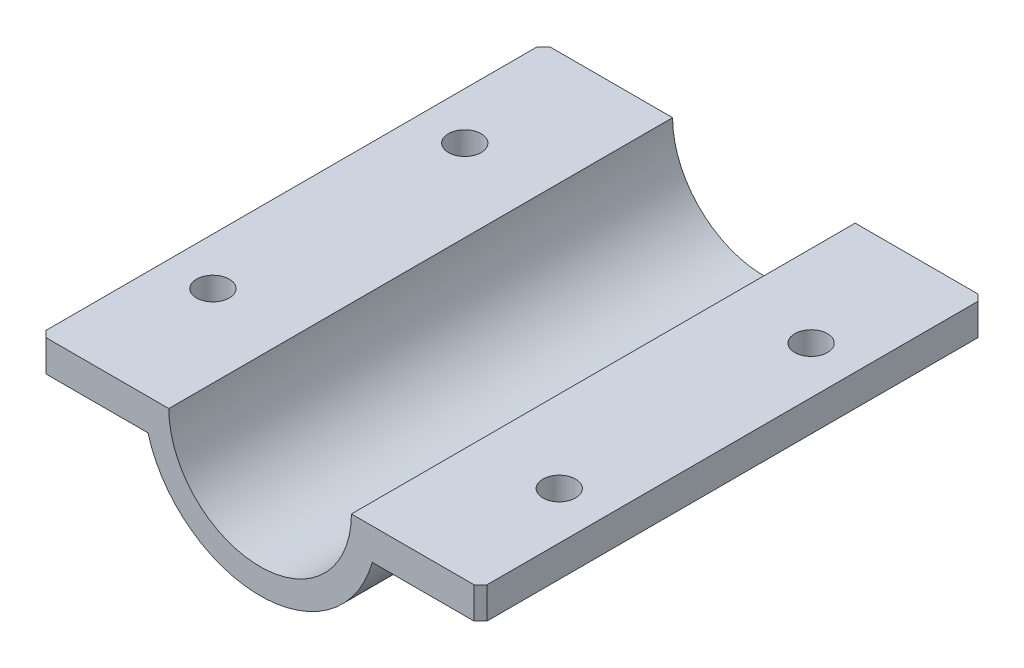
ISO-10303-21;
HEADER;
FILE_DESCRIPTION(('STEP AP214'),'2;1');
FILE_NAME('part.step','',(''),(''),'','','');
FILE_SCHEMA(('AUTOMOTIVE_DESIGN { 1 0 10303 214 1 1 1 1 }'));
ENDSEC;
DATA;
#1=APPLICATION_CONTEXT('core data for automotive mechanical design processes');
#2=APPLICATION_PROTOCOL_DEFINITION('international standard','automotive_design',2000,#1);
#3=PRODUCT_CONTEXT('',#1,'mechanical');
#4=PRODUCT('Part','Part','',(#3));
#5=PRODUCT_RELATED_PRODUCT_CATEGORY('part','',(#4));
#6=PRODUCT_DEFINITION_FORMATION('','',#4);
#7=PRODUCT_DEFINITION_CONTEXT('part definition',#1,'design');
#8=PRODUCT_DEFINITION('design','',#6,#7);
#9=PRODUCT_DEFINITION_SHAPE('','',#8);
#10=(LENGTH_UNIT() NAMED_UNIT(*) SI_UNIT(.MILLI.,.METRE.));
#11=(NAMED_UNIT(*) PLANE_ANGLE_UNIT() SI_UNIT($,.RADIAN.));
#12=(NAMED_UNIT(*) SI_UNIT($,.STERADIAN.) SOLID_ANGLE_UNIT());
#13=UNCERTAINTY_MEASURE_WITH_UNIT(LENGTH_MEASURE(1.E-05),#10,'distance_accuracy_value','');
#14=(GEOMETRIC_REPRESENTATION_CONTEXT(3) GLOBAL_UNCERTAINTY_ASSIGNED_CONTEXT((#13)) GLOBAL_UNIT_ASSIGNED_CONTEXT((#10,
#11,#12)) REPRESENTATION_CONTEXT('',''));
#15=CARTESIAN_POINT('',(0.,0.,0.));
#16=DIRECTION('',(0.,0.,1.));
#17=DIRECTION('',(1.,0.,0.));
#18=AXIS2_PLACEMENT_3D('',#15,#16,#17);
#19=CARTESIAN_POINT('',(35.,0.,40.));
#20=DIRECTION('',(-1.,0.,0.));
#21=DIRECTION('',(0.,0.,1.));
#22=AXIS2_PLACEMENT_3D('',#19,#20,#21);
#23=PLANE('',#22);
#24=DIRECTION('',(0.,0.,-1.));
#25=VECTOR('',#24,1.);
#26=CARTESIAN_POINT('',(35.,-5.,40.));
#27=LINE('',#26,#25);
#28=CARTESIAN_POINT('',(35.,-5.,39.));
#29=VERTEX_POINT('',#28);
#30=CARTESIAN_POINT('',(35.,-5.,-39.));
#31=VERTEX_POINT('',#30);
#32=EDGE_CURVE('E164',#29,#31,#27,.T.);
#33=ORIENTED_EDGE('',*,*,#32,.T.);
#34=DIRECTION('',(0.,1.,0.));
#35=VECTOR('',#34,1.);
#36=CARTESIAN_POINT('',(35.,0.,-39.));
#37=LINE('',#36,#35);
#38=CARTESIAN_POINT('',(35.,0.,-39.));
#39=VERTEX_POINT('',#38);
#40=EDGE_CURVE('E214',#31,#39,#37,.T.);
#41=ORIENTED_EDGE('',*,*,#40,.T.);
#42=DIRECTION('',(0.,0.,-1.));
#43=VECTOR('',#42,1.);
#44=CARTESIAN_POINT('',(35.,0.,40.));
#45=LINE('',#44,#43);
#46=CARTESIAN_POINT('',(35.,0.,39.));
#47=VERTEX_POINT('',#46);
#48=EDGE_CURVE('E147',#47,#39,#45,.T.);
#49=ORIENTED_EDGE('',*,*,#48,.F.);
#50=DIRECTION('',(0.,-1.,0.));
#51=VECTOR('',#50,1.);
#52=CARTESIAN_POINT('',(35.,-5.,39.));
#53=LINE('',#52,#51);
#54=EDGE_CURVE('E212',#47,#29,#53,.T.);
#55=ORIENTED_EDGE('',*,*,#54,.T.);
#56=EDGE_LOOP('',(#33,#41,#49,#55));
#57=FACE_BOUND('',#56,.T.);
#58=ADVANCED_FACE('F38',(#57),#23,.F.);
#59=CARTESIAN_POINT('',(35.,0.,40.));
#60=DIRECTION('',(0.,-1.,0.));
#61=DIRECTION('',(1.,0.,0.));
#62=AXIS2_PLACEMENT_3D('',#59,#60,#61);
#63=PLANE('',#62);
#64=CARTESIAN_POINT('',(27.5,0.,20.));
#65=DIRECTION('',(0.,-1.,0.));
#66=DIRECTION('',(1.,0.,0.));
#67=AXIS2_PLACEMENT_3D('',#64,#65,#66);
#68=CIRCLE('',#67,2.6);
#69=CARTESIAN_POINT('',(30.1,0.,20.));
#70=VERTEX_POINT('',#69);
#71=EDGE_CURVE('E319',#70,#70,#68,.T.);
#72=ORIENTED_EDGE('',*,*,#71,.T.);
#73=EDGE_LOOP('',(#72));
#74=FACE_BOUND('',#73,.T.);
#75=CARTESIAN_POINT('',(27.5,0.,-20.));
#76=DIRECTION('',(0.,-1.,0.));
#77=DIRECTION('',(1.,0.,0.));
#78=AXIS2_PLACEMENT_3D('',#75,#76,#77);
#79=CIRCLE('',#78,2.6);
#80=CARTESIAN_POINT('',(30.1,0.,-20.));
#81=VERTEX_POINT('',#80);
#82=EDGE_CURVE('E317',#81,#81,#79,.T.);
#83=ORIENTED_EDGE('',*,*,#82,.T.);
#84=EDGE_LOOP('',(#83));
#85=FACE_BOUND('',#84,.T.);
#86=ORIENTED_EDGE('',*,*,#48,.T.);
#87=DIRECTION('',(0.707106781186552,0.,0.707106781186543));
#88=VECTOR('',#87,1.);
#89=CARTESIAN_POINT('',(35.,0.,-39.));
#90=LINE('',#89,#88);
#91=CARTESIAN_POINT('',(34.,0.,-40.));
#92=VERTEX_POINT('',#91);
#93=EDGE_CURVE('E218',#39,#92,#90,.F.);
#94=ORIENTED_EDGE('',*,*,#93,.T.);
#95=DIRECTION('',(-1.,0.,0.));
#96=VECTOR('',#95,1.);
#97=CARTESIAN_POINT('',(35.,0.,-40.));
#98=LINE('',#97,#96);
#99=CARTESIAN_POINT('',(14.5,0.,-40.));
#100=VERTEX_POINT('',#99);
#101=EDGE_CURVE('E144',#92,#100,#98,.T.);
#102=ORIENTED_EDGE('',*,*,#101,.T.);
#103=DIRECTION('',(0.,0.,-1.));
#104=VECTOR('',#103,1.);
#105=CARTESIAN_POINT('',(14.5,0.,40.));
#106=LINE('',#105,#104);
#107=CARTESIAN_POINT('',(14.5,0.,40.));
#108=VERTEX_POINT('',#107);
#109=EDGE_CURVE('E140',#108,#100,#106,.T.);
#110=ORIENTED_EDGE('',*,*,#109,.F.);
#111=DIRECTION('',(-1.,0.,0.));
#112=VECTOR('',#111,1.);
#113=CARTESIAN_POINT('',(35.,0.,40.));
#114=LINE('',#113,#112);
#115=CARTESIAN_POINT('',(34.,0.,40.));
#116=VERTEX_POINT('',#115);
#117=EDGE_CURVE('E129',#116,#108,#114,.T.);
#118=ORIENTED_EDGE('',*,*,#117,.F.);
#119=DIRECTION('',(0.707106781186543,0.,-0.707106781186552));
#120=VECTOR('',#119,1.);
#121=CARTESIAN_POINT('',(34.,0.,40.));
#122=LINE('',#121,#120);
#123=EDGE_CURVE('E62',#116,#47,#122,.T.);
#124=ORIENTED_EDGE('',*,*,#123,.T.);
#125=EDGE_LOOP('',(#86,#94,#102,#110,#118,#124));
#126=FACE_BOUND('',#125,.T.);
#127=ADVANCED_FACE('F142',(#74,#85,#126),#63,.F.);
#128=CARTESIAN_POINT('',(0.,0.,40.));
#129=DIRECTION('',(0.,0.,-1.));
#130=DIRECTION('',(-1.,0.,0.));
#131=AXIS2_PLACEMENT_3D('',#128,#129,#130);
#132=CYLINDRICAL_SURFACE('',#131,14.5);
#133=CARTESIAN_POINT('',(0.,0.,-40.));
#134=DIRECTION('',(0.,0.,-1.));
#135=DIRECTION('',(1.,0.,0.));
#136=AXIS2_PLACEMENT_3D('',#133,#134,#135);
#137=CIRCLE('',#136,14.5);
#138=CARTESIAN_POINT('',(-14.5,0.,-40.));
#139=VERTEX_POINT('',#138);
#140=EDGE_CURVE('E166',#100,#139,#137,.T.);
#141=ORIENTED_EDGE('',*,*,#140,.T.);
#142=DIRECTION('',(0.,0.,-1.));
#143=VECTOR('',#142,1.);
#144=CARTESIAN_POINT('',(-14.5,0.,40.));
#145=LINE('',#144,#143);
#146=CARTESIAN_POINT('',(-14.5,0.,40.));
#147=VERTEX_POINT('',#146);
#148=EDGE_CURVE('E148',#147,#139,#145,.T.);
#149=ORIENTED_EDGE('',*,*,#148,.F.);
#150=CARTESIAN_POINT('',(0.,0.,40.));
#151=DIRECTION('',(0.,0.,-1.));
#152=DIRECTION('',(1.,0.,0.));
#153=AXIS2_PLACEMENT_3D('',#150,#151,#152);
#154=CIRCLE('',#153,14.5);
#155=EDGE_CURVE('E134',#108,#147,#154,.T.);
#156=ORIENTED_EDGE('',*,*,#155,.F.);
#157=ORIENTED_EDGE('',*,*,#109,.T.);
#158=EDGE_LOOP('',(#141,#149,#156,#157));
#159=FACE_BOUND('',#158,.T.);
#160=ADVANCED_FACE('F150',(#159),#132,.F.);
#161=CARTESIAN_POINT('',(-14.5,0.,40.));
#162=DIRECTION('',(0.,-1.,0.));
#163=DIRECTION('',(1.,0.,0.));
#164=AXIS2_PLACEMENT_3D('',#161,#162,#163);
#165=PLANE('',#164);
#166=CARTESIAN_POINT('',(-27.5,0.,-20.));
#167=DIRECTION('',(0.,-1.,0.));
#168=DIRECTION('',(1.,0.,0.));
#169=AXIS2_PLACEMENT_3D('',#166,#167,#168);
#170=CIRCLE('',#169,2.6);
#171=CARTESIAN_POINT('',(-24.9,0.,-20.));
#172=VERTEX_POINT('',#171);
#173=EDGE_CURVE('E167',#172,#172,#170,.T.);
#174=ORIENTED_EDGE('',*,*,#173,.T.);
#175=EDGE_LOOP('',(#174));
#176=FACE_BOUND('',#175,.T.);
#177=CARTESIAN_POINT('',(-27.5,0.,20.));
#178=DIRECTION('',(0.,-1.,0.));
#179=DIRECTION('',(1.,0.,0.));
#180=AXIS2_PLACEMENT_3D('',#177,#178,#179);
#181=CIRCLE('',#180,2.6);
#182=CARTESIAN_POINT('',(-24.9,0.,20.));
#183=VERTEX_POINT('',#182);
#184=EDGE_CURVE('E323',#183,#183,#181,.T.);
#185=ORIENTED_EDGE('',*,*,#184,.T.);
#186=EDGE_LOOP('',(#185));
#187=FACE_BOUND('',#186,.T.);
#188=DIRECTION('',(-1.,0.,0.));
#189=VECTOR('',#188,1.);
#190=CARTESIAN_POINT('',(-14.5,0.,-40.));
#191=LINE('',#190,#189);
#192=CARTESIAN_POINT('',(-34.,0.,-40.));
#193=VERTEX_POINT('',#192);
#194=EDGE_CURVE('E169',#139,#193,#191,.T.);
#195=ORIENTED_EDGE('',*,*,#194,.T.);
#196=DIRECTION('',(0.707106781186552,0.,-0.707106781186543));
#197=VECTOR('',#196,1.);
#198=CARTESIAN_POINT('',(-35.,0.,-39.));
#199=LINE('',#198,#197);
#200=CARTESIAN_POINT('',(-35.,0.,-39.));
#201=VERTEX_POINT('',#200);
#202=EDGE_CURVE('E210',#193,#201,#199,.F.);
#203=ORIENTED_EDGE('',*,*,#202,.T.);
#204=DIRECTION('',(0.,0.,-1.));
#205=VECTOR('',#204,1.);
#206=CARTESIAN_POINT('',(-35.,0.,40.));
#207=LINE('',#206,#205);
#208=CARTESIAN_POINT('',(-35.,0.,39.));
#209=VERTEX_POINT('',#208);
#210=EDGE_CURVE('E190',#209,#201,#207,.T.);
#211=ORIENTED_EDGE('',*,*,#210,.F.);
#212=DIRECTION('',(0.707106781186543,0.,0.707106781186552));
#213=VECTOR('',#212,1.);
#214=CARTESIAN_POINT('',(-34.,0.,40.));
#215=LINE('',#214,#213);
#216=CARTESIAN_POINT('',(-34.,0.,40.));
#217=VERTEX_POINT('',#216);
#218=EDGE_CURVE('E208',#209,#217,#215,.T.);
#219=ORIENTED_EDGE('',*,*,#218,.T.);
#220=DIRECTION('',(-1.,0.,0.));
#221=VECTOR('',#220,1.);
#222=CARTESIAN_POINT('',(-14.5,0.,40.));
#223=LINE('',#222,#221);
#224=EDGE_CURVE('E153',#147,#217,#223,.T.);
#225=ORIENTED_EDGE('',*,*,#224,.F.);
#226=ORIENTED_EDGE('',*,*,#148,.T.);
#227=EDGE_LOOP('',(#195,#203,#211,#219,#225,#226));
#228=FACE_BOUND('',#227,.T.);
#229=ADVANCED_FACE('F250',(#176,#187,#228),#165,.F.);
#230=CARTESIAN_POINT('',(-35.,0.,40.));
#231=DIRECTION('',(1.,0.,0.));
#232=DIRECTION('',(0.,0.,-1.));
#233=AXIS2_PLACEMENT_3D('',#230,#231,#232);
#234=PLANE('',#233);
#235=ORIENTED_EDGE('',*,*,#210,.T.);
#236=DIRECTION('',(0.,-1.,0.));
#237=VECTOR('',#236,1.);
#238=CARTESIAN_POINT('',(-35.,0.,-39.));
#239=LINE('',#238,#237);
#240=CARTESIAN_POINT('',(-35.,-5.,-39.));
#241=VERTEX_POINT('',#240);
#242=EDGE_CURVE('E197',#201,#241,#239,.T.);
#243=ORIENTED_EDGE('',*,*,#242,.T.);
#244=DIRECTION('',(0.,0.,-1.));
#245=VECTOR('',#244,1.);
#246=CARTESIAN_POINT('',(-35.,-5.,40.));
#247=LINE('',#246,#245);
#248=CARTESIAN_POINT('',(-35.,-5.,39.));
#249=VERTEX_POINT('',#248);
#250=EDGE_CURVE('E187',#249,#241,#247,.T.);
#251=ORIENTED_EDGE('',*,*,#250,.F.);
#252=DIRECTION('',(0.,1.,0.));
#253=VECTOR('',#252,1.);
#254=CARTESIAN_POINT('',(-35.,0.,39.));
#255=LINE('',#254,#253);
#256=EDGE_CURVE('E195',#249,#209,#255,.T.);
#257=ORIENTED_EDGE('',*,*,#256,.T.);
#258=EDGE_LOOP('',(#235,#243,#251,#257));
#259=FACE_BOUND('',#258,.T.);
#260=ADVANCED_FACE('F255',(#259),#234,.F.);
#261=CARTESIAN_POINT('',(-21.9374109684803,-5.00000000000001,40.));
#262=DIRECTION('',(0.,1.,0.));
#263=DIRECTION('',(0.,0.,1.));
#264=AXIS2_PLACEMENT_3D('',#261,#262,#263);
#265=PLANE('',#264);
#266=CARTESIAN_POINT('',(-27.5,-5.00000000000001,-20.));
#267=DIRECTION('',(0.,-1.,0.));
#268=DIRECTION('',(0.,0.,1.));
#269=AXIS2_PLACEMENT_3D('',#266,#267,#268);
#270=CIRCLE('',#269,2.6);
#271=CARTESIAN_POINT('',(-27.5,-5.00000000000001,-17.4));
#272=VERTEX_POINT('',#271);
#273=EDGE_CURVE('E326',#272,#272,#270,.T.);
#274=ORIENTED_EDGE('',*,*,#273,.F.);
#275=EDGE_LOOP('',(#274));
#276=FACE_BOUND('',#275,.T.);
#277=CARTESIAN_POINT('',(-27.5,-5.00000000000001,20.));
#278=DIRECTION('',(0.,-1.,0.));
#279=DIRECTION('',(0.,0.,-1.));
#280=AXIS2_PLACEMENT_3D('',#277,#278,#279);
#281=CIRCLE('',#280,2.6);
#282=CARTESIAN_POINT('',(-27.5,-5.00000000000001,17.4));
#283=VERTEX_POINT('',#282);
#284=EDGE_CURVE('E320',#283,#283,#281,.T.);
#285=ORIENTED_EDGE('',*,*,#284,.F.);
#286=EDGE_LOOP('',(#285));
#287=FACE_BOUND('',#286,.T.);
#288=ORIENTED_EDGE('',*,*,#250,.T.);
#289=DIRECTION('',(-0.707106781186552,0.,0.707106781186543));
#290=VECTOR('',#289,1.);
#291=CARTESIAN_POINT('',(-35.,-5.00000000000001,-39.));
#292=LINE('',#291,#290);
#293=CARTESIAN_POINT('',(-34.,-5.00000000000001,-40.));
#294=VERTEX_POINT('',#293);
#295=EDGE_CURVE('E202',#241,#294,#292,.F.);
#296=ORIENTED_EDGE('',*,*,#295,.T.);
#297=DIRECTION('',(1.,0.,0.));
#298=VECTOR('',#297,1.);
#299=CARTESIAN_POINT('',(-21.9374109684803,-5.00000000000001,-40.));
#300=LINE('',#299,#298);
#301=CARTESIAN_POINT('',(-17.8115131305569,-5.00000000000001,-40.));
#302=VERTEX_POINT('',#301);
#303=EDGE_CURVE('E172',#294,#302,#300,.T.);
#304=ORIENTED_EDGE('',*,*,#303,.T.);
#305=DIRECTION('',(0.,0.,-1.));
#306=VECTOR('',#305,1.);
#307=CARTESIAN_POINT('',(-17.8115131305569,-5.00000000000001,40.));
#308=LINE('',#307,#306);
#309=CARTESIAN_POINT('',(-17.8115131305569,-5.00000000000001,40.));
#310=VERTEX_POINT('',#309);
#311=EDGE_CURVE('E184',#310,#302,#308,.T.);
#312=ORIENTED_EDGE('',*,*,#311,.F.);
#313=DIRECTION('',(1.,0.,0.));
#314=VECTOR('',#313,1.);
#315=CARTESIAN_POINT('',(-35.,-5.,40.));
#316=LINE('',#315,#314);
#317=CARTESIAN_POINT('',(-34.,-5.,40.));
#318=VERTEX_POINT('',#317);
#319=EDGE_CURVE('E155',#318,#310,#316,.T.);
#320=ORIENTED_EDGE('',*,*,#319,.F.);
#321=DIRECTION('',(-0.707106781186543,0.,-0.707106781186552));
#322=VECTOR('',#321,1.);
#323=CARTESIAN_POINT('',(-34.,-5.00000000000001,40.));
#324=LINE('',#323,#322);
#325=EDGE_CURVE('E200',#318,#249,#324,.T.);
#326=ORIENTED_EDGE('',*,*,#325,.T.);
#327=EDGE_LOOP('',(#288,#296,#304,#312,#320,#326));
#328=FACE_BOUND('',#327,.T.);
#329=ADVANCED_FACE('F229',(#276,#287,#328),#265,.F.);
#330=CARTESIAN_POINT('',(0.,0.,40.));
#331=DIRECTION('',(0.,0.,-1.));
#332=DIRECTION('',(-1.,0.,0.));
#333=AXIS2_PLACEMENT_3D('',#330,#331,#332);
#334=CYLINDRICAL_SURFACE('',#333,18.5);
#335=CARTESIAN_POINT('',(0.,0.,-40.));
#336=DIRECTION('',(0.,0.,1.));
#337=DIRECTION('',(1.,0.,0.));
#338=AXIS2_PLACEMENT_3D('',#335,#336,#337);
#339=CIRCLE('',#338,18.5);
#340=CARTESIAN_POINT('',(17.8115131305569,-5.,-40.));
#341=VERTEX_POINT('',#340);
#342=EDGE_CURVE('E174',#302,#341,#339,.T.);
#343=ORIENTED_EDGE('',*,*,#342,.T.);
#344=DIRECTION('',(0.,0.,-1.));
#345=VECTOR('',#344,1.);
#346=CARTESIAN_POINT('',(17.8115131305569,-5.,40.));
#347=LINE('',#346,#345);
#348=CARTESIAN_POINT('',(17.8115131305569,-5.,40.));
#349=VERTEX_POINT('',#348);
#350=EDGE_CURVE('E181',#349,#341,#347,.T.);
#351=ORIENTED_EDGE('',*,*,#350,.F.);
#352=CARTESIAN_POINT('',(0.,0.,40.));
#353=DIRECTION('',(0.,0.,1.));
#354=DIRECTION('',(1.,0.,0.));
#355=AXIS2_PLACEMENT_3D('',#352,#353,#354);
#356=CIRCLE('',#355,18.5);
#357=EDGE_CURVE('E160',#310,#349,#356,.T.);
#358=ORIENTED_EDGE('',*,*,#357,.F.);
#359=ORIENTED_EDGE('',*,*,#311,.T.);
#360=EDGE_LOOP('',(#343,#351,#358,#359));
#361=FACE_BOUND('',#360,.T.);
#362=ADVANCED_FACE('F236',(#361),#334,.T.);
#363=CARTESIAN_POINT('',(35.,-5.,40.));
#364=DIRECTION('',(0.,1.,0.));
#365=DIRECTION('',(-1.,0.,0.));
#366=AXIS2_PLACEMENT_3D('',#363,#364,#365);
#367=PLANE('',#366);
#368=CARTESIAN_POINT('',(27.5,-5.00000000000001,20.));
#369=DIRECTION('',(0.,-1.,0.));
#370=DIRECTION('',(0.,0.,1.));
#371=AXIS2_PLACEMENT_3D('',#368,#369,#370);
#372=CIRCLE('',#371,2.6);
#373=CARTESIAN_POINT('',(27.5,-5.00000000000001,22.6));
#374=VERTEX_POINT('',#373);
#375=EDGE_CURVE('E337',#374,#374,#372,.T.);
#376=ORIENTED_EDGE('',*,*,#375,.F.);
#377=EDGE_LOOP('',(#376));
#378=FACE_BOUND('',#377,.T.);
#379=CARTESIAN_POINT('',(27.5,-5.00000000000001,-20.));
#380=DIRECTION('',(0.,-1.,0.));
#381=DIRECTION('',(0.,0.,-1.));
#382=AXIS2_PLACEMENT_3D('',#379,#380,#381);
#383=CIRCLE('',#382,2.6);
#384=CARTESIAN_POINT('',(27.5,-5.00000000000001,-22.6));
#385=VERTEX_POINT('',#384);
#386=EDGE_CURVE('E314',#385,#385,#383,.T.);
#387=ORIENTED_EDGE('',*,*,#386,.F.);
#388=EDGE_LOOP('',(#387));
#389=FACE_BOUND('',#388,.T.);
#390=DIRECTION('',(1.,0.,0.));
#391=VECTOR('',#390,1.);
#392=CARTESIAN_POINT('',(35.,-5.,-40.));
#393=LINE('',#392,#391);
#394=CARTESIAN_POINT('',(34.,-5.,-40.));
#395=VERTEX_POINT('',#394);
#396=EDGE_CURVE('E137',#341,#395,#393,.T.);
#397=ORIENTED_EDGE('',*,*,#396,.T.);
#398=DIRECTION('',(-0.707106781186552,0.,-0.707106781186543));
#399=VECTOR('',#398,1.);
#400=CARTESIAN_POINT('',(35.,-5.,-39.));
#401=LINE('',#400,#399);
#402=EDGE_CURVE('E221',#395,#31,#401,.F.);
#403=ORIENTED_EDGE('',*,*,#402,.T.);
#404=ORIENTED_EDGE('',*,*,#32,.F.);
#405=DIRECTION('',(-0.707106781186543,0.,0.707106781186552));
#406=VECTOR('',#405,1.);
#407=CARTESIAN_POINT('',(34.,-5.,40.));
#408=LINE('',#407,#406);
#409=CARTESIAN_POINT('',(34.,-5.,40.));
#410=VERTEX_POINT('',#409);
#411=EDGE_CURVE('E54',#29,#410,#408,.T.);
#412=ORIENTED_EDGE('',*,*,#411,.T.);
#413=DIRECTION('',(1.,0.,0.));
#414=VECTOR('',#413,1.);
#415=CARTESIAN_POINT('',(21.9374109684803,-5.,40.));
#416=LINE('',#415,#414);
#417=EDGE_CURVE('E162',#349,#410,#416,.T.);
#418=ORIENTED_EDGE('',*,*,#417,.F.);
#419=ORIENTED_EDGE('',*,*,#350,.T.);
#420=EDGE_LOOP('',(#397,#403,#404,#412,#418,#419));
#421=FACE_BOUND('',#420,.T.);
#422=ADVANCED_FACE('F241',(#378,#389,#421),#367,.F.);
#423=CARTESIAN_POINT('',(0.,0.,40.));
#424=DIRECTION('',(0.,0.,1.));
#425=DIRECTION('',(1.,0.,0.));
#426=AXIS2_PLACEMENT_3D('',#423,#424,#425);
#427=PLANE('',#426);
#428=ORIENTED_EDGE('',*,*,#417,.T.);
#429=DIRECTION('',(0.,1.,0.));
#430=VECTOR('',#429,1.);
#431=CARTESIAN_POINT('',(34.,0.,40.));
#432=LINE('',#431,#430);
#433=EDGE_CURVE('E11',#410,#116,#432,.T.);
#434=ORIENTED_EDGE('',*,*,#433,.T.);
#435=ORIENTED_EDGE('',*,*,#117,.T.);
#436=ORIENTED_EDGE('',*,*,#155,.T.);
#437=ORIENTED_EDGE('',*,*,#224,.T.);
#438=DIRECTION('',(0.,-1.,0.));
#439=VECTOR('',#438,1.);
#440=CARTESIAN_POINT('',(-34.,-5.,40.));
#441=LINE('',#440,#439);
#442=EDGE_CURVE('E47',#217,#318,#441,.T.);
#443=ORIENTED_EDGE('',*,*,#442,.T.);
#444=ORIENTED_EDGE('',*,*,#319,.T.);
#445=ORIENTED_EDGE('',*,*,#357,.T.);
#446=EDGE_LOOP('',(#428,#434,#435,#436,#437,#443,#444,#445));
#447=FACE_BOUND('',#446,.T.);
#448=ADVANCED_FACE('F131',(#447),#427,.T.);
#449=CARTESIAN_POINT('',(0.,0.,-40.));
#450=DIRECTION('',(0.,0.,1.));
#451=DIRECTION('',(1.,0.,0.));
#452=AXIS2_PLACEMENT_3D('',#449,#450,#451);
#453=PLANE('',#452);
#454=ORIENTED_EDGE('',*,*,#303,.F.);
#455=DIRECTION('',(0.,1.,0.));
#456=VECTOR('',#455,1.);
#457=CARTESIAN_POINT('',(-34.,0.,-40.));
#458=LINE('',#457,#456);
#459=EDGE_CURVE('E206',#294,#193,#458,.T.);
#460=ORIENTED_EDGE('',*,*,#459,.T.);
#461=ORIENTED_EDGE('',*,*,#194,.F.);
#462=ORIENTED_EDGE('',*,*,#140,.F.);
#463=ORIENTED_EDGE('',*,*,#101,.F.);
#464=DIRECTION('',(0.,-1.,0.));
#465=VECTOR('',#464,1.);
#466=CARTESIAN_POINT('',(34.,0.,-40.));
#467=LINE('',#466,#465);
#468=EDGE_CURVE('E204',#92,#395,#467,.T.);
#469=ORIENTED_EDGE('',*,*,#468,.T.);
#470=ORIENTED_EDGE('',*,*,#396,.F.);
#471=ORIENTED_EDGE('',*,*,#342,.F.);
#472=EDGE_LOOP('',(#454,#460,#461,#462,#463,#469,#470,#471));
#473=FACE_BOUND('',#472,.T.);
#474=ADVANCED_FACE('F247',(#473),#453,.F.);
#475=CARTESIAN_POINT('',(27.5,4.99999999999999,-20.));
#476=DIRECTION('',(0.,-1.,0.));
#477=DIRECTION('',(0.,0.,-1.));
#478=AXIS2_PLACEMENT_3D('',#475,#476,#477);
#479=CYLINDRICAL_SURFACE('',#478,2.6);
#480=ORIENTED_EDGE('',*,*,#386,.T.);
#481=EDGE_LOOP('',(#480));
#482=FACE_BOUND('',#481,.T.);
#483=ORIENTED_EDGE('',*,*,#82,.F.);
#484=EDGE_LOOP('',(#483));
#485=FACE_BOUND('',#484,.T.);
#486=ADVANCED_FACE('F297',(#482,#485),#479,.F.);
#487=CARTESIAN_POINT('',(27.5,4.99999999999999,20.));
#488=DIRECTION('',(0.,-1.,0.));
#489=DIRECTION('',(0.,0.,-1.));
#490=AXIS2_PLACEMENT_3D('',#487,#488,#489);
#491=CYLINDRICAL_SURFACE('',#490,2.6);
#492=ORIENTED_EDGE('',*,*,#375,.T.);
#493=EDGE_LOOP('',(#492));
#494=FACE_BOUND('',#493,.T.);
#495=ORIENTED_EDGE('',*,*,#71,.F.);
#496=EDGE_LOOP('',(#495));
#497=FACE_BOUND('',#496,.T.);
#498=ADVANCED_FACE('F302',(#494,#497),#491,.F.);
#499=CARTESIAN_POINT('',(-27.5,4.99999999999999,20.));
#500=DIRECTION('',(0.,-1.,0.));
#501=DIRECTION('',(0.,0.,-1.));
#502=AXIS2_PLACEMENT_3D('',#499,#500,#501);
#503=CYLINDRICAL_SURFACE('',#502,2.6);
#504=ORIENTED_EDGE('',*,*,#284,.T.);
#505=EDGE_LOOP('',(#504));
#506=FACE_BOUND('',#505,.T.);
#507=ORIENTED_EDGE('',*,*,#184,.F.);
#508=EDGE_LOOP('',(#507));
#509=FACE_BOUND('',#508,.T.);
#510=ADVANCED_FACE('F268',(#506,#509),#503,.F.);
#511=CARTESIAN_POINT('',(-27.5,4.99999999999999,-20.));
#512=DIRECTION('',(0.,-1.,0.));
#513=DIRECTION('',(0.,0.,-1.));
#514=AXIS2_PLACEMENT_3D('',#511,#512,#513);
#515=CYLINDRICAL_SURFACE('',#514,2.6);
#516=ORIENTED_EDGE('',*,*,#273,.T.);
#517=EDGE_LOOP('',(#516));
#518=FACE_BOUND('',#517,.T.);
#519=ORIENTED_EDGE('',*,*,#173,.F.);
#520=EDGE_LOOP('',(#519));
#521=FACE_BOUND('',#520,.T.);
#522=ADVANCED_FACE('F261',(#518,#521),#515,.F.);
#523=CARTESIAN_POINT('',(-35.,0.,-39.));
#524=DIRECTION('',(0.707106781186543,0.,0.707106781186552));
#525=DIRECTION('',(0.,-1.,0.));
#526=AXIS2_PLACEMENT_3D('',#523,#524,#525);
#527=PLANE('',#526);
#528=ORIENTED_EDGE('',*,*,#202,.F.);
#529=ORIENTED_EDGE('',*,*,#459,.F.);
#530=ORIENTED_EDGE('',*,*,#295,.F.);
#531=ORIENTED_EDGE('',*,*,#242,.F.);
#532=EDGE_LOOP('',(#528,#529,#530,#531));
#533=FACE_BOUND('',#532,.T.);
#534=ADVANCED_FACE('F259',(#533),#527,.F.);
#535=CARTESIAN_POINT('',(35.,0.,-39.));
#536=DIRECTION('',(-0.707106781186543,0.,0.707106781186552));
#537=DIRECTION('',(0.,1.,0.));
#538=AXIS2_PLACEMENT_3D('',#535,#536,#537);
#539=PLANE('',#538);
#540=ORIENTED_EDGE('',*,*,#402,.F.);
#541=ORIENTED_EDGE('',*,*,#468,.F.);
#542=ORIENTED_EDGE('',*,*,#93,.F.);
#543=ORIENTED_EDGE('',*,*,#40,.F.);
#544=EDGE_LOOP('',(#540,#541,#542,#543));
#545=FACE_BOUND('',#544,.T.);
#546=ADVANCED_FACE('F245',(#545),#539,.F.);
#547=CARTESIAN_POINT('',(34.,0.,40.));
#548=DIRECTION('',(0.707106781186552,0.,0.707106781186543));
#549=DIRECTION('',(0.,-1.,0.));
#550=AXIS2_PLACEMENT_3D('',#547,#548,#549);
#551=PLANE('',#550);
#552=ORIENTED_EDGE('',*,*,#411,.F.);
#553=ORIENTED_EDGE('',*,*,#54,.F.);
#554=ORIENTED_EDGE('',*,*,#123,.F.);
#555=ORIENTED_EDGE('',*,*,#433,.F.);
#556=EDGE_LOOP('',(#552,#553,#554,#555));
#557=FACE_BOUND('',#556,.T.);
#558=ADVANCED_FACE('F237',(#557),#551,.T.);
#559=CARTESIAN_POINT('',(-34.,0.,40.));
#560=DIRECTION('',(-0.707106781186552,0.,0.707106781186543));
#561=DIRECTION('',(0.,1.,0.));
#562=AXIS2_PLACEMENT_3D('',#559,#560,#561);
#563=PLANE('',#562);
#564=ORIENTED_EDGE('',*,*,#218,.F.);
#565=ORIENTED_EDGE('',*,*,#256,.F.);
#566=ORIENTED_EDGE('',*,*,#325,.F.);
#567=ORIENTED_EDGE('',*,*,#442,.F.);
#568=EDGE_LOOP('',(#564,#565,#566,#567));
#569=FACE_BOUND('',#568,.T.);
#570=ADVANCED_FACE('F41',(#569),#563,.T.);
#571=CLOSED_SHELL('',(#58,#127,#160,#229,#260,#329,#362,#422,#448,#474,#486,#498,#510,#522,#534,
#546,#558,#570));
#572=MANIFOLD_SOLID_BREP('B2',#571);
#573=ADVANCED_BREP_SHAPE_REPRESENTATION('',(#18,#572),#14);
#574=SHAPE_DEFINITION_REPRESENTATION(#9,#573);
ENDSEC;
END-ISO-10303-21;
